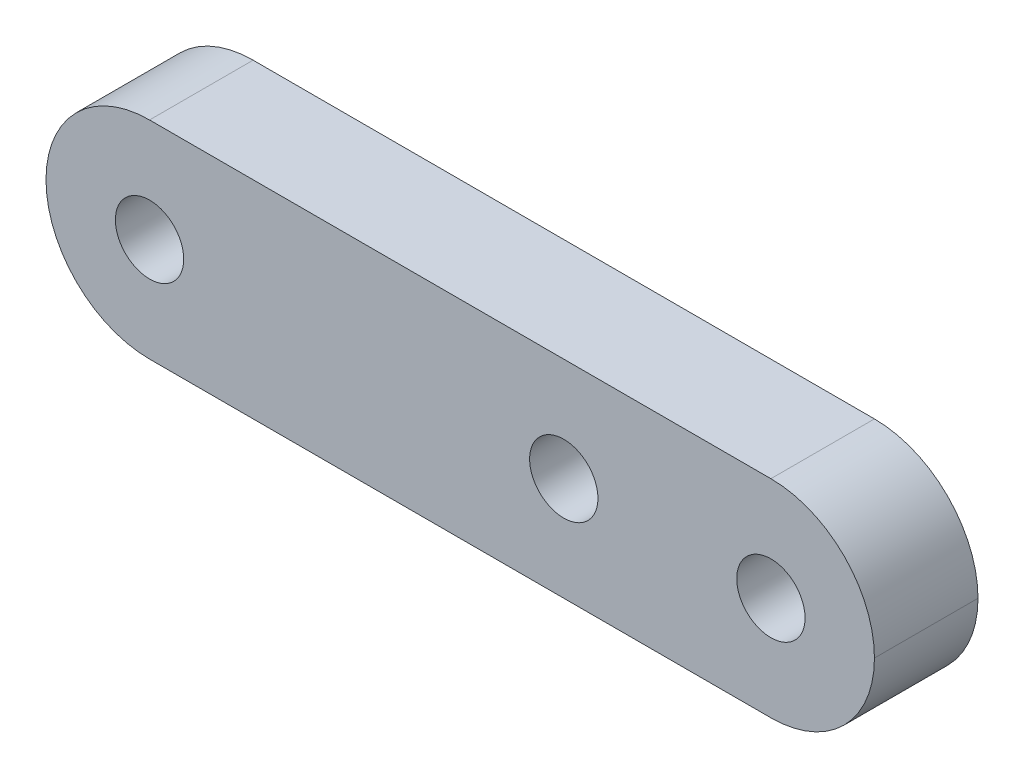
ISO-10303-21;
HEADER;
FILE_DESCRIPTION(('STEP AP214'),'2;1');
FILE_NAME('part.step','',(''),(''),'','','');
FILE_SCHEMA(('AUTOMOTIVE_DESIGN { 1 0 10303 214 1 1 1 1 }'));
ENDSEC;
DATA;
#1=APPLICATION_CONTEXT('core data for automotive mechanical design processes');
#2=APPLICATION_PROTOCOL_DEFINITION('international standard','automotive_design',2000,#1);
#3=PRODUCT_CONTEXT('',#1,'mechanical');
#4=PRODUCT('Part','Part','',(#3));
#5=PRODUCT_RELATED_PRODUCT_CATEGORY('part','',(#4));
#6=PRODUCT_DEFINITION_FORMATION('','',#4);
#7=PRODUCT_DEFINITION_CONTEXT('part definition',#1,'design');
#8=PRODUCT_DEFINITION('design','',#6,#7);
#9=PRODUCT_DEFINITION_SHAPE('','',#8);
#10=(LENGTH_UNIT() NAMED_UNIT(*) SI_UNIT(.MILLI.,.METRE.));
#11=(NAMED_UNIT(*) PLANE_ANGLE_UNIT() SI_UNIT($,.RADIAN.));
#12=(NAMED_UNIT(*) SI_UNIT($,.STERADIAN.) SOLID_ANGLE_UNIT());
#13=UNCERTAINTY_MEASURE_WITH_UNIT(LENGTH_MEASURE(1.E-05),#10,'distance_accuracy_value','');
#14=(GEOMETRIC_REPRESENTATION_CONTEXT(3) GLOBAL_UNCERTAINTY_ASSIGNED_CONTEXT((#13)) GLOBAL_UNIT_ASSIGNED_CONTEXT((#10,
#11,#12)) REPRESENTATION_CONTEXT('',''));
#15=CARTESIAN_POINT('',(0.,0.,0.));
#16=DIRECTION('',(0.,0.,1.));
#17=DIRECTION('',(1.,0.,0.));
#18=AXIS2_PLACEMENT_3D('',#15,#16,#17);
#19=CARTESIAN_POINT('',(0.,0.,5.));
#20=DIRECTION('',(0.,1.,0.));
#21=DIRECTION('',(0.,0.,1.));
#22=AXIS2_PLACEMENT_3D('',#19,#20,#21);
#23=PLANE('',#22);
#24=DIRECTION('',(1.,0.,0.));
#25=VECTOR('',#24,1.);
#26=CARTESIAN_POINT('',(0.,0.,0.));
#27=LINE('',#26,#25);
#28=CARTESIAN_POINT('',(5.,0.,0.));
#29=VERTEX_POINT('',#28);
#30=CARTESIAN_POINT('',(35.,0.,0.));
#31=VERTEX_POINT('',#30);
#32=EDGE_CURVE('E93',#29,#31,#27,.T.);
#33=ORIENTED_EDGE('',*,*,#32,.T.);
#34=DIRECTION('',(0.,0.,-1.));
#35=VECTOR('',#34,1.);
#36=CARTESIAN_POINT('',(35.,0.,5.));
#37=LINE('',#36,#35);
#38=CARTESIAN_POINT('',(35.,0.,5.));
#39=VERTEX_POINT('',#38);
#40=EDGE_CURVE('E123',#31,#39,#37,.F.);
#41=ORIENTED_EDGE('',*,*,#40,.T.);
#42=DIRECTION('',(1.,0.,0.));
#43=VECTOR('',#42,1.);
#44=CARTESIAN_POINT('',(0.,0.,5.));
#45=LINE('',#44,#43);
#46=CARTESIAN_POINT('',(5.,0.,5.));
#47=VERTEX_POINT('',#46);
#48=EDGE_CURVE('E133',#47,#39,#45,.T.);
#49=ORIENTED_EDGE('',*,*,#48,.F.);
#50=DIRECTION('',(0.,0.,-1.));
#51=VECTOR('',#50,1.);
#52=CARTESIAN_POINT('',(5.,0.,5.));
#53=LINE('',#52,#51);
#54=EDGE_CURVE('E126',#47,#29,#53,.T.);
#55=ORIENTED_EDGE('',*,*,#54,.T.);
#56=EDGE_LOOP('',(#33,#41,#49,#55));
#57=FACE_BOUND('',#56,.T.);
#58=ADVANCED_FACE('F34',(#57),#23,.F.);
#59=CARTESIAN_POINT('',(0.,10.,5.));
#60=DIRECTION('',(0.,-1.,0.));
#61=DIRECTION('',(0.,0.,-1.));
#62=AXIS2_PLACEMENT_3D('',#59,#60,#61);
#63=PLANE('',#62);
#64=DIRECTION('',(-1.,0.,0.));
#65=VECTOR('',#64,1.);
#66=CARTESIAN_POINT('',(0.,10.,5.));
#67=LINE('',#66,#65);
#68=CARTESIAN_POINT('',(35.,10.,5.));
#69=VERTEX_POINT('',#68);
#70=CARTESIAN_POINT('',(5.,10.,5.));
#71=VERTEX_POINT('',#70);
#72=EDGE_CURVE('E105',#69,#71,#67,.T.);
#73=ORIENTED_EDGE('',*,*,#72,.F.);
#74=DIRECTION('',(0.,0.,-1.));
#75=VECTOR('',#74,1.);
#76=CARTESIAN_POINT('',(35.,10.,5.));
#77=LINE('',#76,#75);
#78=CARTESIAN_POINT('',(35.,10.,0.));
#79=VERTEX_POINT('',#78);
#80=EDGE_CURVE('E11',#69,#79,#77,.T.);
#81=ORIENTED_EDGE('',*,*,#80,.T.);
#82=DIRECTION('',(-1.,0.,0.));
#83=VECTOR('',#82,1.);
#84=CARTESIAN_POINT('',(0.,10.,0.));
#85=LINE('',#84,#83);
#86=CARTESIAN_POINT('',(5.,10.,0.));
#87=VERTEX_POINT('',#86);
#88=EDGE_CURVE('E131',#79,#87,#85,.T.);
#89=ORIENTED_EDGE('',*,*,#88,.T.);
#90=DIRECTION('',(0.,0.,-1.));
#91=VECTOR('',#90,1.);
#92=CARTESIAN_POINT('',(5.,10.,5.));
#93=LINE('',#92,#91);
#94=EDGE_CURVE('E43',#87,#71,#93,.F.);
#95=ORIENTED_EDGE('',*,*,#94,.T.);
#96=EDGE_LOOP('',(#73,#81,#89,#95));
#97=FACE_BOUND('',#96,.T.);
#98=ADVANCED_FACE('F157',(#97),#63,.F.);
#99=CARTESIAN_POINT('',(0.,0.,5.));
#100=DIRECTION('',(0.,0.,-1.));
#101=DIRECTION('',(-1.,0.,0.));
#102=AXIS2_PLACEMENT_3D('',#99,#100,#101);
#103=PLANE('',#102);
#104=CARTESIAN_POINT('',(25.,5.,5.));
#105=DIRECTION('',(0.,0.,1.));
#106=DIRECTION('',(1.,0.,0.));
#107=AXIS2_PLACEMENT_3D('',#104,#105,#106);
#108=CIRCLE('',#107,1.65);
#109=CARTESIAN_POINT('',(26.65,5.,5.));
#110=VERTEX_POINT('',#109);
#111=EDGE_CURVE('E114',#110,#110,#108,.T.);
#112=ORIENTED_EDGE('',*,*,#111,.F.);
#113=EDGE_LOOP('',(#112));
#114=FACE_BOUND('',#113,.T.);
#115=CARTESIAN_POINT('',(35.,5.,5.));
#116=DIRECTION('',(0.,0.,1.));
#117=DIRECTION('',(1.,0.,0.));
#118=AXIS2_PLACEMENT_3D('',#115,#116,#117);
#119=CIRCLE('',#118,1.65);
#120=CARTESIAN_POINT('',(36.65,5.,5.));
#121=VERTEX_POINT('',#120);
#122=EDGE_CURVE('E111',#121,#121,#119,.T.);
#123=ORIENTED_EDGE('',*,*,#122,.F.);
#124=EDGE_LOOP('',(#123));
#125=FACE_BOUND('',#124,.T.);
#126=CARTESIAN_POINT('',(5.,5.,5.));
#127=DIRECTION('',(0.,0.,1.));
#128=DIRECTION('',(1.,0.,0.));
#129=AXIS2_PLACEMENT_3D('',#126,#127,#128);
#130=CIRCLE('',#129,1.65);
#131=CARTESIAN_POINT('',(6.65,5.,5.));
#132=VERTEX_POINT('',#131);
#133=EDGE_CURVE('E139',#132,#132,#130,.T.);
#134=ORIENTED_EDGE('',*,*,#133,.F.);
#135=EDGE_LOOP('',(#134));
#136=FACE_BOUND('',#135,.T.);
#137=ORIENTED_EDGE('',*,*,#48,.T.);
#138=CARTESIAN_POINT('',(35.,5.,5.));
#139=DIRECTION('',(0.,0.,-1.));
#140=DIRECTION('',(-1.,0.,0.));
#141=AXIS2_PLACEMENT_3D('',#138,#139,#140);
#142=CIRCLE('',#141,5.);
#143=CARTESIAN_POINT('',(40.,5.,5.));
#144=VERTEX_POINT('',#143);
#145=EDGE_CURVE('E117',#39,#144,#142,.F.);
#146=ORIENTED_EDGE('',*,*,#145,.T.);
#147=CARTESIAN_POINT('',(35.,5.,5.));
#148=DIRECTION('',(0.,0.,-1.));
#149=DIRECTION('',(-1.,0.,0.));
#150=AXIS2_PLACEMENT_3D('',#147,#148,#149);
#151=CIRCLE('',#150,5.);
#152=EDGE_CURVE('E57',#144,#69,#151,.F.);
#153=ORIENTED_EDGE('',*,*,#152,.T.);
#154=ORIENTED_EDGE('',*,*,#72,.T.);
#155=CARTESIAN_POINT('',(5.,5.,5.));
#156=DIRECTION('',(0.,0.,-1.));
#157=DIRECTION('',(-1.,0.,0.));
#158=AXIS2_PLACEMENT_3D('',#155,#156,#157);
#159=CIRCLE('',#158,5.);
#160=CARTESIAN_POINT('',(0.,5.,5.));
#161=VERTEX_POINT('',#160);
#162=EDGE_CURVE('E121',#71,#161,#159,.F.);
#163=ORIENTED_EDGE('',*,*,#162,.T.);
#164=CARTESIAN_POINT('',(5.,5.,5.));
#165=DIRECTION('',(0.,0.,-1.));
#166=DIRECTION('',(-1.,0.,0.));
#167=AXIS2_PLACEMENT_3D('',#164,#165,#166);
#168=CIRCLE('',#167,5.);
#169=EDGE_CURVE('E108',#161,#47,#168,.F.);
#170=ORIENTED_EDGE('',*,*,#169,.T.);
#171=EDGE_LOOP('',(#137,#146,#153,#154,#163,#170));
#172=FACE_BOUND('',#171,.T.);
#173=ADVANCED_FACE('F154',(#114,#125,#136,#172),#103,.F.);
#174=CARTESIAN_POINT('',(0.,0.,0.));
#175=DIRECTION('',(0.,0.,-1.));
#176=DIRECTION('',(-1.,0.,0.));
#177=AXIS2_PLACEMENT_3D('',#174,#175,#176);
#178=PLANE('',#177);
#179=CARTESIAN_POINT('',(25.,5.,0.));
#180=DIRECTION('',(0.,0.,-1.));
#181=DIRECTION('',(-1.,0.,0.));
#182=AXIS2_PLACEMENT_3D('',#179,#180,#181);
#183=CIRCLE('',#182,1.65);
#184=CARTESIAN_POINT('',(23.35,5.,0.));
#185=VERTEX_POINT('',#184);
#186=EDGE_CURVE('E38',#185,#185,#183,.T.);
#187=ORIENTED_EDGE('',*,*,#186,.F.);
#188=EDGE_LOOP('',(#187));
#189=FACE_BOUND('',#188,.T.);
#190=CARTESIAN_POINT('',(35.,5.,0.));
#191=DIRECTION('',(0.,0.,1.));
#192=DIRECTION('',(1.,0.,0.));
#193=AXIS2_PLACEMENT_3D('',#190,#191,#192);
#194=CIRCLE('',#193,1.65);
#195=CARTESIAN_POINT('',(36.65,5.,0.));
#196=VERTEX_POINT('',#195);
#197=EDGE_CURVE('E142',#196,#196,#194,.T.);
#198=ORIENTED_EDGE('',*,*,#197,.T.);
#199=EDGE_LOOP('',(#198));
#200=FACE_BOUND('',#199,.T.);
#201=CARTESIAN_POINT('',(5.,5.,0.));
#202=DIRECTION('',(0.,0.,1.));
#203=DIRECTION('',(1.,0.,0.));
#204=AXIS2_PLACEMENT_3D('',#201,#202,#203);
#205=CIRCLE('',#204,1.65);
#206=CARTESIAN_POINT('',(6.65,5.,0.));
#207=VERTEX_POINT('',#206);
#208=EDGE_CURVE('E135',#207,#207,#205,.T.);
#209=ORIENTED_EDGE('',*,*,#208,.T.);
#210=EDGE_LOOP('',(#209));
#211=FACE_BOUND('',#210,.T.);
#212=CARTESIAN_POINT('',(35.,5.,0.));
#213=DIRECTION('',(0.,0.,-1.));
#214=DIRECTION('',(-1.,0.,0.));
#215=AXIS2_PLACEMENT_3D('',#212,#213,#214);
#216=CIRCLE('',#215,5.);
#217=CARTESIAN_POINT('',(40.,5.,0.));
#218=VERTEX_POINT('',#217);
#219=EDGE_CURVE('E98',#79,#218,#216,.T.);
#220=ORIENTED_EDGE('',*,*,#219,.T.);
#221=CARTESIAN_POINT('',(35.,5.,0.));
#222=DIRECTION('',(0.,0.,-1.));
#223=DIRECTION('',(-1.,0.,0.));
#224=AXIS2_PLACEMENT_3D('',#221,#222,#223);
#225=CIRCLE('',#224,5.);
#226=EDGE_CURVE('E128',#218,#31,#225,.T.);
#227=ORIENTED_EDGE('',*,*,#226,.T.);
#228=ORIENTED_EDGE('',*,*,#32,.F.);
#229=CARTESIAN_POINT('',(5.,5.,0.));
#230=DIRECTION('',(0.,0.,-1.));
#231=DIRECTION('',(-1.,0.,0.));
#232=AXIS2_PLACEMENT_3D('',#229,#230,#231);
#233=CIRCLE('',#232,5.);
#234=CARTESIAN_POINT('',(0.,5.,0.));
#235=VERTEX_POINT('',#234);
#236=EDGE_CURVE('E87',#29,#235,#233,.T.);
#237=ORIENTED_EDGE('',*,*,#236,.T.);
#238=CARTESIAN_POINT('',(5.,5.,0.));
#239=DIRECTION('',(0.,0.,-1.));
#240=DIRECTION('',(-1.,0.,0.));
#241=AXIS2_PLACEMENT_3D('',#238,#239,#240);
#242=CIRCLE('',#241,5.);
#243=EDGE_CURVE('E91',#235,#87,#242,.T.);
#244=ORIENTED_EDGE('',*,*,#243,.T.);
#245=ORIENTED_EDGE('',*,*,#88,.F.);
#246=EDGE_LOOP('',(#220,#227,#228,#237,#244,#245));
#247=FACE_BOUND('',#246,.T.);
#248=ADVANCED_FACE('F89',(#189,#200,#211,#247),#178,.T.);
#249=CARTESIAN_POINT('',(5.,5.,0.));
#250=DIRECTION('',(0.,0.,1.));
#251=DIRECTION('',(1.,0.,0.));
#252=AXIS2_PLACEMENT_3D('',#249,#250,#251);
#253=CYLINDRICAL_SURFACE('',#252,1.65);
#254=ORIENTED_EDGE('',*,*,#208,.F.);
#255=EDGE_LOOP('',(#254));
#256=FACE_BOUND('',#255,.T.);
#257=ORIENTED_EDGE('',*,*,#133,.T.);
#258=EDGE_LOOP('',(#257));
#259=FACE_BOUND('',#258,.T.);
#260=ADVANCED_FACE('F209',(#256,#259),#253,.F.);
#261=CARTESIAN_POINT('',(35.,5.,0.));
#262=DIRECTION('',(0.,0.,1.));
#263=DIRECTION('',(1.,0.,0.));
#264=AXIS2_PLACEMENT_3D('',#261,#262,#263);
#265=CYLINDRICAL_SURFACE('',#264,1.65);
#266=ORIENTED_EDGE('',*,*,#197,.F.);
#267=EDGE_LOOP('',(#266));
#268=FACE_BOUND('',#267,.T.);
#269=ORIENTED_EDGE('',*,*,#122,.T.);
#270=EDGE_LOOP('',(#269));
#271=FACE_BOUND('',#270,.T.);
#272=ADVANCED_FACE('F184',(#268,#271),#265,.F.);
#273=CARTESIAN_POINT('',(35.,5.,5.));
#274=DIRECTION('',(0.,0.,-1.));
#275=DIRECTION('',(-1.,0.,0.));
#276=AXIS2_PLACEMENT_3D('',#273,#274,#275);
#277=CYLINDRICAL_SURFACE('',#276,5.);
#278=ORIENTED_EDGE('',*,*,#80,.F.);
#279=ORIENTED_EDGE('',*,*,#152,.F.);
#280=DIRECTION('',(0.,0.,-1.));
#281=VECTOR('',#280,1.);
#282=CARTESIAN_POINT('',(40.,5.,5.));
#283=LINE('',#282,#281);
#284=EDGE_CURVE('E109',#218,#144,#283,.F.);
#285=ORIENTED_EDGE('',*,*,#284,.F.);
#286=ORIENTED_EDGE('',*,*,#219,.F.);
#287=EDGE_LOOP('',(#278,#279,#285,#286));
#288=FACE_BOUND('',#287,.T.);
#289=ADVANCED_FACE('F172',(#288),#277,.T.);
#290=CARTESIAN_POINT('',(35.,5.,5.));
#291=DIRECTION('',(0.,0.,-1.));
#292=DIRECTION('',(-1.,0.,0.));
#293=AXIS2_PLACEMENT_3D('',#290,#291,#292);
#294=CYLINDRICAL_SURFACE('',#293,5.);
#295=ORIENTED_EDGE('',*,*,#145,.F.);
#296=ORIENTED_EDGE('',*,*,#40,.F.);
#297=ORIENTED_EDGE('',*,*,#226,.F.);
#298=ORIENTED_EDGE('',*,*,#284,.T.);
#299=EDGE_LOOP('',(#295,#296,#297,#298));
#300=FACE_BOUND('',#299,.T.);
#301=ADVANCED_FACE('F167',(#300),#294,.T.);
#302=CARTESIAN_POINT('',(5.,5.,5.));
#303=DIRECTION('',(0.,0.,-1.));
#304=DIRECTION('',(-1.,0.,0.));
#305=AXIS2_PLACEMENT_3D('',#302,#303,#304);
#306=CYLINDRICAL_SURFACE('',#305,5.);
#307=DIRECTION('',(0.,0.,-1.));
#308=VECTOR('',#307,1.);
#309=CARTESIAN_POINT('',(0.,5.,5.));
#310=LINE('',#309,#308);
#311=EDGE_CURVE('E103',#161,#235,#310,.T.);
#312=ORIENTED_EDGE('',*,*,#311,.F.);
#313=ORIENTED_EDGE('',*,*,#162,.F.);
#314=ORIENTED_EDGE('',*,*,#94,.F.);
#315=ORIENTED_EDGE('',*,*,#243,.F.);
#316=EDGE_LOOP('',(#312,#313,#314,#315));
#317=FACE_BOUND('',#316,.T.);
#318=ADVANCED_FACE('F36',(#317),#306,.T.);
#319=CARTESIAN_POINT('',(5.,5.,5.));
#320=DIRECTION('',(0.,0.,-1.));
#321=DIRECTION('',(-1.,0.,0.));
#322=AXIS2_PLACEMENT_3D('',#319,#320,#321);
#323=CYLINDRICAL_SURFACE('',#322,5.);
#324=ORIENTED_EDGE('',*,*,#169,.F.);
#325=ORIENTED_EDGE('',*,*,#311,.T.);
#326=ORIENTED_EDGE('',*,*,#236,.F.);
#327=ORIENTED_EDGE('',*,*,#54,.F.);
#328=EDGE_LOOP('',(#324,#325,#326,#327));
#329=FACE_BOUND('',#328,.T.);
#330=ADVANCED_FACE('F107',(#329),#323,.T.);
#331=CARTESIAN_POINT('',(25.,5.,-5.));
#332=DIRECTION('',(0.,0.,1.));
#333=DIRECTION('',(1.,0.,0.));
#334=AXIS2_PLACEMENT_3D('',#331,#332,#333);
#335=CYLINDRICAL_SURFACE('',#334,1.65);
#336=ORIENTED_EDGE('',*,*,#186,.T.);
#337=EDGE_LOOP('',(#336));
#338=FACE_BOUND('',#337,.T.);
#339=ORIENTED_EDGE('',*,*,#111,.T.);
#340=EDGE_LOOP('',(#339));
#341=FACE_BOUND('',#340,.T.);
#342=ADVANCED_FACE('F152',(#338,#341),#335,.F.);
#343=CLOSED_SHELL('',(#58,#98,#173,#248,#260,#272,#289,#301,#318,#330,#342));
#344=MANIFOLD_SOLID_BREP('B2',#343);
#345=ADVANCED_BREP_SHAPE_REPRESENTATION('',(#18,#344),#14);
#346=SHAPE_DEFINITION_REPRESENTATION(#9,#345);
ENDSEC;
END-ISO-10303-21;
